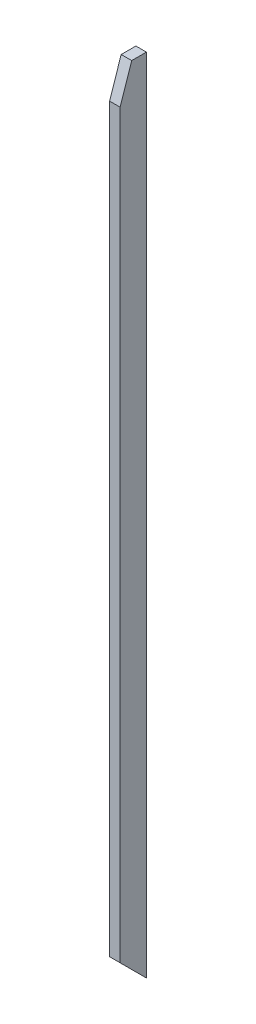
ISO-10303-21;
HEADER;
FILE_DESCRIPTION(('STEP AP214'),'2;1');
FILE_NAME('part.step','',(''),(''),'','','');
FILE_SCHEMA(('AUTOMOTIVE_DESIGN { 1 0 10303 214 1 1 1 1 }'));
ENDSEC;
DATA;
#1=APPLICATION_CONTEXT('core data for automotive mechanical design processes');
#2=APPLICATION_PROTOCOL_DEFINITION('international standard','automotive_design',2000,#1);
#3=PRODUCT_CONTEXT('',#1,'mechanical');
#4=PRODUCT('Part','Part','',(#3));
#5=PRODUCT_RELATED_PRODUCT_CATEGORY('part','',(#4));
#6=PRODUCT_DEFINITION_FORMATION('','',#4);
#7=PRODUCT_DEFINITION_CONTEXT('part definition',#1,'design');
#8=PRODUCT_DEFINITION('design','',#6,#7);
#9=PRODUCT_DEFINITION_SHAPE('','',#8);
#10=(LENGTH_UNIT() NAMED_UNIT(*) SI_UNIT(.MILLI.,.METRE.));
#11=(NAMED_UNIT(*) PLANE_ANGLE_UNIT() SI_UNIT($,.RADIAN.));
#12=(NAMED_UNIT(*) SI_UNIT($,.STERADIAN.) SOLID_ANGLE_UNIT());
#13=UNCERTAINTY_MEASURE_WITH_UNIT(LENGTH_MEASURE(1.E-05),#10,'distance_accuracy_value','');
#14=(GEOMETRIC_REPRESENTATION_CONTEXT(3) GLOBAL_UNCERTAINTY_ASSIGNED_CONTEXT((#13)) GLOBAL_UNIT_ASSIGNED_CONTEXT((#10,
#11,#12)) REPRESENTATION_CONTEXT('',''));
#15=CARTESIAN_POINT('',(0.,0.,0.));
#16=DIRECTION('',(0.,0.,1.));
#17=DIRECTION('',(1.,0.,0.));
#18=AXIS2_PLACEMENT_3D('',#15,#16,#17);
#19=CARTESIAN_POINT('',(-675.,408.968714288993,-768.));
#20=DIRECTION('',(0.,0.,-1.));
#21=DIRECTION('',(0.,1.,0.));
#22=AXIS2_PLACEMENT_3D('',#19,#20,#21);
#23=PLANE('',#22);
#24=DIRECTION('',(-1.,0.,0.));
#25=VECTOR('',#24,1.);
#26=CARTESIAN_POINT('',(-675.,-295.807667811865,-768.));
#27=LINE('',#26,#25);
#28=CARTESIAN_POINT('',(-665.,-295.807667811865,-768.));
#29=VERTEX_POINT('',#28);
#30=CARTESIAN_POINT('',(-675.,-295.807667811865,-768.));
#31=VERTEX_POINT('',#30);
#32=EDGE_CURVE('E95',#29,#31,#27,.T.);
#33=ORIENTED_EDGE('',*,*,#32,.F.);
#34=DIRECTION('',(0.,1.,0.));
#35=VECTOR('',#34,1.);
#36=CARTESIAN_POINT('',(-665.,408.968714288993,-768.));
#37=LINE('',#36,#35);
#38=CARTESIAN_POINT('',(-665.,408.968714288993,-768.));
#39=VERTEX_POINT('',#38);
#40=EDGE_CURVE('E101',#29,#39,#37,.T.);
#41=ORIENTED_EDGE('',*,*,#40,.T.);
#42=DIRECTION('',(1.,0.,0.));
#43=VECTOR('',#42,1.);
#44=CARTESIAN_POINT('',(-675.,408.968714288993,-768.));
#45=LINE('',#44,#43);
#46=CARTESIAN_POINT('',(-675.,408.968714288993,-768.));
#47=VERTEX_POINT('',#46);
#48=EDGE_CURVE('E48',#47,#39,#45,.T.);
#49=ORIENTED_EDGE('',*,*,#48,.F.);
#50=DIRECTION('',(0.,1.,0.));
#51=VECTOR('',#50,1.);
#52=CARTESIAN_POINT('',(-675.,408.968714288993,-768.));
#53=LINE('',#52,#51);
#54=EDGE_CURVE('E85',#31,#47,#53,.T.);
#55=ORIENTED_EDGE('',*,*,#54,.F.);
#56=EDGE_LOOP('',(#33,#41,#49,#55));
#57=FACE_BOUND('',#56,.T.);
#58=ADVANCED_FACE('F39',(#57),#23,.F.);
#59=CARTESIAN_POINT('',(-675.,-343.145999984699,-793.));
#60=DIRECTION('',(0.,0.,1.));
#61=DIRECTION('',(0.,-1.,0.));
#62=AXIS2_PLACEMENT_3D('',#59,#60,#61);
#63=PLANE('',#62);
#64=DIRECTION('',(1.,0.,0.));
#65=VECTOR('',#64,1.);
#66=CARTESIAN_POINT('',(-2015.,-320.807667811865,-793.));
#67=LINE('',#66,#65);
#68=CARTESIAN_POINT('',(-675.,-320.807667811865,-793.));
#69=VERTEX_POINT('',#68);
#70=CARTESIAN_POINT('',(-665.,-320.807667811865,-793.));
#71=VERTEX_POINT('',#70);
#72=EDGE_CURVE('E55',#69,#71,#67,.T.);
#73=ORIENTED_EDGE('',*,*,#72,.F.);
#74=DIRECTION('',(0.,-1.,0.));
#75=VECTOR('',#74,1.);
#76=CARTESIAN_POINT('',(-675.,-343.145999984699,-793.));
#77=LINE('',#76,#75);
#78=CARTESIAN_POINT('',(-675.,441.854000015301,-793.));
#79=VERTEX_POINT('',#78);
#80=EDGE_CURVE('E113',#79,#69,#77,.T.);
#81=ORIENTED_EDGE('',*,*,#80,.F.);
#82=DIRECTION('',(1.,0.,0.));
#83=VECTOR('',#82,1.);
#84=CARTESIAN_POINT('',(-675.,441.854000015301,-793.));
#85=LINE('',#84,#83);
#86=CARTESIAN_POINT('',(-665.,441.854000015301,-793.));
#87=VERTEX_POINT('',#86);
#88=EDGE_CURVE('E126',#79,#87,#85,.T.);
#89=ORIENTED_EDGE('',*,*,#88,.T.);
#90=DIRECTION('',(0.,-1.,0.));
#91=VECTOR('',#90,1.);
#92=CARTESIAN_POINT('',(-665.,-343.145999984699,-793.));
#93=LINE('',#92,#91);
#94=EDGE_CURVE('E121',#87,#71,#93,.T.);
#95=ORIENTED_EDGE('',*,*,#94,.T.);
#96=EDGE_LOOP('',(#73,#81,#89,#95));
#97=FACE_BOUND('',#96,.T.);
#98=ADVANCED_FACE('F140',(#97),#63,.F.);
#99=CARTESIAN_POINT('',(-675.,0.,0.));
#100=DIRECTION('',(1.,0.,0.));
#101=DIRECTION('',(0.,0.,-1.));
#102=AXIS2_PLACEMENT_3D('',#99,#100,#101);
#103=PLANE('',#102);
#104=DIRECTION('',(0.,-0.70710678118654,-0.707106781186555));
#105=VECTOR('',#104,1.);
#106=CARTESIAN_POINT('',(-675.,236.096166094064,-236.096166094059));
#107=LINE('',#106,#105);
#108=EDGE_CURVE('E103',#31,#69,#107,.T.);
#109=ORIENTED_EDGE('',*,*,#108,.F.);
#110=ORIENTED_EDGE('',*,*,#54,.T.);
#111=DIRECTION('',(0.,0.948351963788959,-0.317220038423843));
#112=VECTOR('',#111,1.);
#113=CARTESIAN_POINT('',(-675.,441.854000015301,-779.));
#114=LINE('',#113,#112);
#115=CARTESIAN_POINT('',(-675.,441.854000015301,-779.));
#116=VERTEX_POINT('',#115);
#117=EDGE_CURVE('E133',#47,#116,#114,.T.);
#118=ORIENTED_EDGE('',*,*,#117,.T.);
#119=DIRECTION('',(0.,0.,-1.));
#120=VECTOR('',#119,1.);
#121=CARTESIAN_POINT('',(-675.,441.854000015301,-793.));
#122=LINE('',#121,#120);
#123=EDGE_CURVE('E63',#116,#79,#122,.T.);
#124=ORIENTED_EDGE('',*,*,#123,.T.);
#125=ORIENTED_EDGE('',*,*,#80,.T.);
#126=EDGE_LOOP('',(#109,#110,#118,#124,#125));
#127=FACE_BOUND('',#126,.T.);
#128=ADVANCED_FACE('F141',(#127),#103,.F.);
#129=CARTESIAN_POINT('',(-665.,0.,0.));
#130=DIRECTION('',(1.,0.,0.));
#131=DIRECTION('',(0.,0.,-1.));
#132=AXIS2_PLACEMENT_3D('',#129,#130,#131);
#133=PLANE('',#132);
#134=ORIENTED_EDGE('',*,*,#40,.F.);
#135=DIRECTION('',(0.,-0.70710678118654,-0.707106781186555));
#136=VECTOR('',#135,1.);
#137=CARTESIAN_POINT('',(-665.,236.096166094064,-236.096166094059));
#138=LINE('',#137,#136);
#139=EDGE_CURVE('E12',#29,#71,#138,.T.);
#140=ORIENTED_EDGE('',*,*,#139,.T.);
#141=ORIENTED_EDGE('',*,*,#94,.F.);
#142=DIRECTION('',(0.,0.,-1.));
#143=VECTOR('',#142,1.);
#144=CARTESIAN_POINT('',(-665.,441.854000015301,-793.));
#145=LINE('',#144,#143);
#146=CARTESIAN_POINT('',(-665.,441.854000015301,-779.));
#147=VERTEX_POINT('',#146);
#148=EDGE_CURVE('E80',#147,#87,#145,.T.);
#149=ORIENTED_EDGE('',*,*,#148,.F.);
#150=DIRECTION('',(0.,0.948351963788959,-0.317220038423843));
#151=VECTOR('',#150,1.);
#152=CARTESIAN_POINT('',(-665.,441.854000015301,-779.));
#153=LINE('',#152,#151);
#154=EDGE_CURVE('E107',#39,#147,#153,.T.);
#155=ORIENTED_EDGE('',*,*,#154,.F.);
#156=EDGE_LOOP('',(#134,#140,#141,#149,#155));
#157=FACE_BOUND('',#156,.T.);
#158=ADVANCED_FACE('F106',(#157),#133,.T.);
#159=CARTESIAN_POINT('',(-675.,441.854000015301,-779.));
#160=DIRECTION('',(0.,-0.317220038423843,-0.948351963788959));
#161=DIRECTION('',(0.,0.948351963788959,-0.317220038423843));
#162=AXIS2_PLACEMENT_3D('',#159,#160,#161);
#163=PLANE('',#162);
#164=ORIENTED_EDGE('',*,*,#154,.T.);
#165=DIRECTION('',(1.,0.,0.));
#166=VECTOR('',#165,1.);
#167=CARTESIAN_POINT('',(-675.,441.854000015301,-779.));
#168=LINE('',#167,#166);
#169=EDGE_CURVE('E128',#116,#147,#168,.T.);
#170=ORIENTED_EDGE('',*,*,#169,.F.);
#171=ORIENTED_EDGE('',*,*,#117,.F.);
#172=ORIENTED_EDGE('',*,*,#48,.T.);
#173=EDGE_LOOP('',(#164,#170,#171,#172));
#174=FACE_BOUND('',#173,.T.);
#175=ADVANCED_FACE('F131',(#174),#163,.F.);
#176=CARTESIAN_POINT('',(-675.,441.854000015301,-793.));
#177=DIRECTION('',(0.,-1.,0.));
#178=DIRECTION('',(0.,0.,-1.));
#179=AXIS2_PLACEMENT_3D('',#176,#177,#178);
#180=PLANE('',#179);
#181=ORIENTED_EDGE('',*,*,#148,.T.);
#182=ORIENTED_EDGE('',*,*,#88,.F.);
#183=ORIENTED_EDGE('',*,*,#123,.F.);
#184=ORIENTED_EDGE('',*,*,#169,.T.);
#185=EDGE_LOOP('',(#181,#182,#183,#184));
#186=FACE_BOUND('',#185,.T.);
#187=ADVANCED_FACE('F182',(#186),#180,.F.);
#188=CARTESIAN_POINT('',(-2015.,-320.807667811865,-793.));
#189=DIRECTION('',(0.,-0.707106781186555,0.70710678118654));
#190=DIRECTION('',(0.,-0.70710678118654,-0.707106781186555));
#191=AXIS2_PLACEMENT_3D('',#188,#189,#190);
#192=PLANE('',#191);
#193=ORIENTED_EDGE('',*,*,#32,.T.);
#194=ORIENTED_EDGE('',*,*,#108,.T.);
#195=ORIENTED_EDGE('',*,*,#72,.T.);
#196=ORIENTED_EDGE('',*,*,#139,.F.);
#197=EDGE_LOOP('',(#193,#194,#195,#196));
#198=FACE_BOUND('',#197,.T.);
#199=ADVANCED_FACE('F94',(#198),#192,.T.);
#200=CLOSED_SHELL('',(#58,#98,#128,#158,#175,#187,#199));
#201=MANIFOLD_SOLID_BREP('B2',#200);
#202=ADVANCED_BREP_SHAPE_REPRESENTATION('',(#18,#201),#14);
#203=SHAPE_DEFINITION_REPRESENTATION(#9,#202);
ENDSEC;
END-ISO-10303-21;
